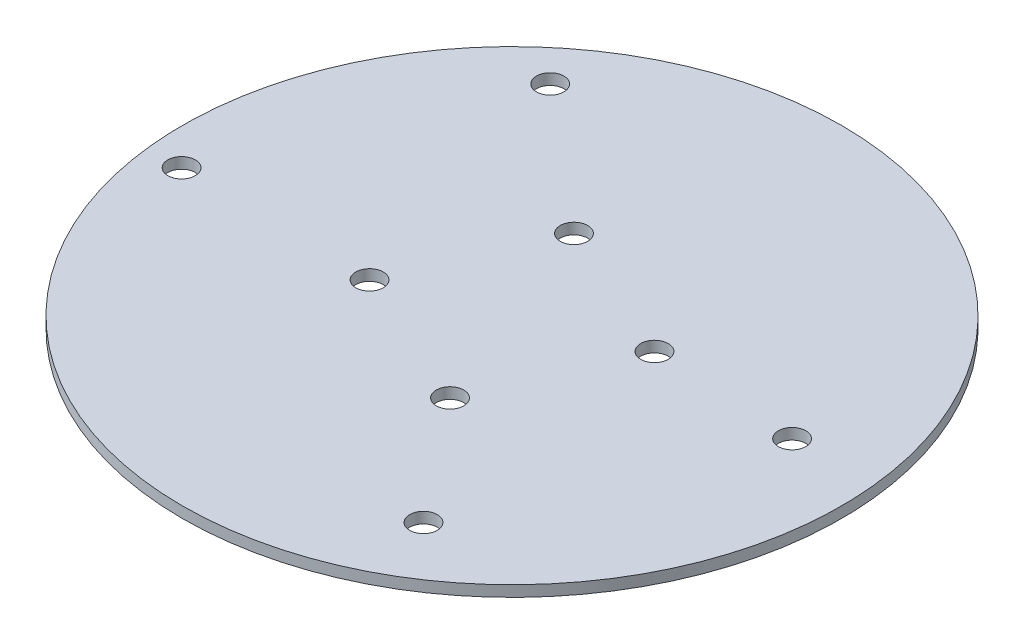
ISO-10303-21;
HEADER;
FILE_DESCRIPTION(('STEP AP214'),'2;1');
FILE_NAME('part.step','',(''),(''),'','','');
FILE_SCHEMA(('AUTOMOTIVE_DESIGN { 1 0 10303 214 1 1 1 1 }'));
ENDSEC;
DATA;
#1=APPLICATION_CONTEXT('core data for automotive mechanical design processes');
#2=APPLICATION_PROTOCOL_DEFINITION('international standard','automotive_design',2000,#1);
#3=PRODUCT_CONTEXT('',#1,'mechanical');
#4=PRODUCT('Part','Part','',(#3));
#5=PRODUCT_RELATED_PRODUCT_CATEGORY('part','',(#4));
#6=PRODUCT_DEFINITION_FORMATION('','',#4);
#7=PRODUCT_DEFINITION_CONTEXT('part definition',#1,'design');
#8=PRODUCT_DEFINITION('design','',#6,#7);
#9=PRODUCT_DEFINITION_SHAPE('','',#8);
#10=(LENGTH_UNIT() NAMED_UNIT(*) SI_UNIT(.MILLI.,.METRE.));
#11=(NAMED_UNIT(*) PLANE_ANGLE_UNIT() SI_UNIT($,.RADIAN.));
#12=(NAMED_UNIT(*) SI_UNIT($,.STERADIAN.) SOLID_ANGLE_UNIT());
#13=UNCERTAINTY_MEASURE_WITH_UNIT(LENGTH_MEASURE(1.E-05),#10,'distance_accuracy_value','');
#14=(GEOMETRIC_REPRESENTATION_CONTEXT(3) GLOBAL_UNCERTAINTY_ASSIGNED_CONTEXT((#13)) GLOBAL_UNIT_ASSIGNED_CONTEXT((#10,
#11,#12)) REPRESENTATION_CONTEXT('',''));
#15=CARTESIAN_POINT('',(0.,0.,0.));
#16=DIRECTION('',(0.,0.,1.));
#17=DIRECTION('',(1.,0.,0.));
#18=AXIS2_PLACEMENT_3D('',#15,#16,#17);
#19=CARTESIAN_POINT('',(0.,2.54,0.));
#20=DIRECTION('',(0.,-1.,0.));
#21=DIRECTION('',(0.,0.,-1.));
#22=AXIS2_PLACEMENT_3D('',#19,#20,#21);
#23=CYLINDRICAL_SURFACE('',#22,76.2);
#24=CARTESIAN_POINT('',(0.,2.54,0.));
#25=DIRECTION('',(0.,1.,0.));
#26=DIRECTION('',(0.,0.,1.));
#27=AXIS2_PLACEMENT_3D('',#24,#25,#26);
#28=CIRCLE('',#27,76.2);
#29=CARTESIAN_POINT('',(0.,2.54,76.2));
#30=VERTEX_POINT('',#29);
#31=EDGE_CURVE('E10',#30,#30,#28,.T.);
#32=ORIENTED_EDGE('',*,*,#31,.F.);
#33=EDGE_LOOP('',(#32));
#34=FACE_BOUND('',#33,.T.);
#35=CARTESIAN_POINT('',(0.,0.,0.));
#36=DIRECTION('',(0.,1.,0.));
#37=DIRECTION('',(0.,0.,1.));
#38=AXIS2_PLACEMENT_3D('',#35,#36,#37);
#39=CIRCLE('',#38,76.2);
#40=CARTESIAN_POINT('',(0.,0.,76.2));
#41=VERTEX_POINT('',#40);
#42=EDGE_CURVE('E34',#41,#41,#39,.T.);
#43=ORIENTED_EDGE('',*,*,#42,.T.);
#44=EDGE_LOOP('',(#43));
#45=FACE_BOUND('',#44,.T.);
#46=ADVANCED_FACE('F31',(#34,#45),#23,.T.);
#47=CARTESIAN_POINT('',(0.,2.54,0.));
#48=DIRECTION('',(0.,1.,0.));
#49=DIRECTION('',(0.,0.,1.));
#50=AXIS2_PLACEMENT_3D('',#47,#48,#49);
#51=PLANE('',#50);
#52=CARTESIAN_POINT('',(-9.30623137465253,2.54,-23.6337482765945));
#53=DIRECTION('',(0.,1.,0.));
#54=DIRECTION('',(0.,0.,1.));
#55=AXIS2_PLACEMENT_3D('',#52,#53,#54);
#56=CIRCLE('',#55,3.175);
#57=CARTESIAN_POINT('',(-9.30623137465253,2.54,-20.4587482765945));
#58=VERTEX_POINT('',#57);
#59=EDGE_CURVE('E85',#58,#58,#56,.T.);
#60=ORIENTED_EDGE('',*,*,#59,.F.);
#61=EDGE_LOOP('',(#60));
#62=FACE_BOUND('',#61,.T.);
#63=CARTESIAN_POINT('',(23.6337482765945,2.54,-9.30623137465261));
#64=DIRECTION('',(0.,1.,0.));
#65=DIRECTION('',(0.,0.,1.));
#66=AXIS2_PLACEMENT_3D('',#63,#64,#65);
#67=CIRCLE('',#66,3.175);
#68=CARTESIAN_POINT('',(23.6337482765945,2.54,-6.13123137465262));
#69=VERTEX_POINT('',#68);
#70=EDGE_CURVE('E79',#69,#69,#67,.T.);
#71=ORIENTED_EDGE('',*,*,#70,.F.);
#72=EDGE_LOOP('',(#71));
#73=FACE_BOUND('',#72,.T.);
#74=CARTESIAN_POINT('',(9.3062313746527,2.54,23.6337482765944));
#75=DIRECTION('',(0.,1.,0.));
#76=DIRECTION('',(0.,0.,1.));
#77=AXIS2_PLACEMENT_3D('',#74,#75,#76);
#78=CIRCLE('',#77,3.175);
#79=CARTESIAN_POINT('',(9.3062313746527,2.54,26.8087482765944));
#80=VERTEX_POINT('',#79);
#81=EDGE_CURVE('E73',#80,#80,#78,.T.);
#82=ORIENTED_EDGE('',*,*,#81,.F.);
#83=EDGE_LOOP('',(#82));
#84=FACE_BOUND('',#83,.T.);
#85=CARTESIAN_POINT('',(-23.6337482765944,2.54,9.30623137465278));
#86=DIRECTION('',(0.,1.,0.));
#87=DIRECTION('',(0.,0.,1.));
#88=AXIS2_PLACEMENT_3D('',#85,#86,#87);
#89=CIRCLE('',#88,3.17499999999997);
#90=CARTESIAN_POINT('',(-23.6337482765944,2.54,12.4812313746527));
#91=VERTEX_POINT('',#90);
#92=EDGE_CURVE('E67',#91,#91,#89,.T.);
#93=ORIENTED_EDGE('',*,*,#92,.F.);
#94=EDGE_LOOP('',(#93));
#95=FACE_BOUND('',#94,.T.);
#96=CARTESIAN_POINT('',(-67.8140618249271,2.54,8.58531875576918));
#97=DIRECTION('',(0.,-1.,0.));
#98=DIRECTION('',(0.,0.,-1.));
#99=AXIS2_PLACEMENT_3D('',#96,#97,#98);
#100=CIRCLE('',#99,3.17499999999997);
#101=CARTESIAN_POINT('',(-67.8140618249271,2.54,5.41031875576921));
#102=VERTEX_POINT('',#101);
#103=EDGE_CURVE('E41',#102,#102,#100,.T.);
#104=ORIENTED_EDGE('',*,*,#103,.T.);
#105=EDGE_LOOP('',(#104));
#106=FACE_BOUND('',#105,.T.);
#107=CARTESIAN_POINT('',(-41.9797967096606,2.54,-50.8094928522671));
#108=DIRECTION('',(0.,-1.,0.));
#109=DIRECTION('',(0.,0.,-1.));
#110=AXIS2_PLACEMENT_3D('',#107,#108,#109);
#111=CIRCLE('',#110,3.17499999999997);
#112=CARTESIAN_POINT('',(-41.9797967096606,2.54,-53.9844928522671));
#113=VERTEX_POINT('',#112);
#114=EDGE_CURVE('E59',#113,#113,#111,.T.);
#115=ORIENTED_EDGE('',*,*,#114,.T.);
#116=EDGE_LOOP('',(#115));
#117=FACE_BOUND('',#116,.T.);
#118=CARTESIAN_POINT('',(57.0115559703999,2.54,-7.75238432682293));
#119=DIRECTION('',(0.,-1.,0.));
#120=DIRECTION('',(0.,0.,-1.));
#121=AXIS2_PLACEMENT_3D('',#118,#119,#120);
#122=CIRCLE('',#121,3.17499999999997);
#123=CARTESIAN_POINT('',(57.0115559703999,2.54,-10.9273843268229));
#124=VERTEX_POINT('',#123);
#125=EDGE_CURVE('E53',#124,#124,#122,.T.);
#126=ORIENTED_EDGE('',*,*,#125,.T.);
#127=EDGE_LOOP('',(#126));
#128=FACE_BOUND('',#127,.T.);
#129=CARTESIAN_POINT('',(31.1772908551334,2.54,51.6424272812133));
#130=DIRECTION('',(0.,-1.,0.));
#131=DIRECTION('',(0.,0.,-1.));
#132=AXIS2_PLACEMENT_3D('',#129,#130,#131);
#133=CIRCLE('',#132,3.17499999999997);
#134=CARTESIAN_POINT('',(31.1772908551334,2.54,48.4674272812134));
#135=VERTEX_POINT('',#134);
#136=EDGE_CURVE('E46',#135,#135,#133,.T.);
#137=ORIENTED_EDGE('',*,*,#136,.T.);
#138=EDGE_LOOP('',(#137));
#139=FACE_BOUND('',#138,.T.);
#140=ORIENTED_EDGE('',*,*,#31,.T.);
#141=EDGE_LOOP('',(#140));
#142=FACE_BOUND('',#141,.T.);
#143=ADVANCED_FACE('F101',(#62,#73,#84,#95,#106,#117,#128,#139,#142),#51,.T.);
#144=CARTESIAN_POINT('',(0.,0.,0.));
#145=DIRECTION('',(0.,1.,0.));
#146=DIRECTION('',(0.,0.,1.));
#147=AXIS2_PLACEMENT_3D('',#144,#145,#146);
#148=PLANE('',#147);
#149=CARTESIAN_POINT('',(-9.30623137465253,0.,-23.6337482765945));
#150=DIRECTION('',(0.,1.,0.));
#151=DIRECTION('',(0.,0.,1.));
#152=AXIS2_PLACEMENT_3D('',#149,#150,#151);
#153=CIRCLE('',#152,3.175);
#154=CARTESIAN_POINT('',(-9.30623137465253,0.,-20.4587482765945));
#155=VERTEX_POINT('',#154);
#156=EDGE_CURVE('E47',#155,#155,#153,.T.);
#157=ORIENTED_EDGE('',*,*,#156,.T.);
#158=EDGE_LOOP('',(#157));
#159=FACE_BOUND('',#158,.T.);
#160=CARTESIAN_POINT('',(23.6337482765945,0.,-9.30623137465261));
#161=DIRECTION('',(0.,1.,0.));
#162=DIRECTION('',(0.,0.,1.));
#163=AXIS2_PLACEMENT_3D('',#160,#161,#162);
#164=CIRCLE('',#163,3.175);
#165=CARTESIAN_POINT('',(23.6337482765945,0.,-6.13123137465262));
#166=VERTEX_POINT('',#165);
#167=EDGE_CURVE('E82',#166,#166,#164,.T.);
#168=ORIENTED_EDGE('',*,*,#167,.T.);
#169=EDGE_LOOP('',(#168));
#170=FACE_BOUND('',#169,.T.);
#171=CARTESIAN_POINT('',(9.3062313746527,0.,23.6337482765944));
#172=DIRECTION('',(0.,1.,0.));
#173=DIRECTION('',(0.,0.,1.));
#174=AXIS2_PLACEMENT_3D('',#171,#172,#173);
#175=CIRCLE('',#174,3.175);
#176=CARTESIAN_POINT('',(9.3062313746527,0.,26.8087482765944));
#177=VERTEX_POINT('',#176);
#178=EDGE_CURVE('E76',#177,#177,#175,.T.);
#179=ORIENTED_EDGE('',*,*,#178,.T.);
#180=EDGE_LOOP('',(#179));
#181=FACE_BOUND('',#180,.T.);
#182=CARTESIAN_POINT('',(-23.6337482765944,0.,9.30623137465278));
#183=DIRECTION('',(0.,1.,0.));
#184=DIRECTION('',(0.,0.,1.));
#185=AXIS2_PLACEMENT_3D('',#182,#183,#184);
#186=CIRCLE('',#185,3.17499999999997);
#187=CARTESIAN_POINT('',(-23.6337482765944,0.,12.4812313746527));
#188=VERTEX_POINT('',#187);
#189=EDGE_CURVE('E70',#188,#188,#186,.T.);
#190=ORIENTED_EDGE('',*,*,#189,.T.);
#191=EDGE_LOOP('',(#190));
#192=FACE_BOUND('',#191,.T.);
#193=CARTESIAN_POINT('',(-67.8140618249271,0.,8.58531875576918));
#194=DIRECTION('',(0.,-1.,0.));
#195=DIRECTION('',(0.,0.,-1.));
#196=AXIS2_PLACEMENT_3D('',#193,#194,#195);
#197=CIRCLE('',#196,3.17499999999997);
#198=CARTESIAN_POINT('',(-67.8140618249271,0.,5.41031875576921));
#199=VERTEX_POINT('',#198);
#200=EDGE_CURVE('E62',#199,#199,#197,.T.);
#201=ORIENTED_EDGE('',*,*,#200,.F.);
#202=EDGE_LOOP('',(#201));
#203=FACE_BOUND('',#202,.T.);
#204=CARTESIAN_POINT('',(-41.9797967096606,0.,-50.8094928522671));
#205=DIRECTION('',(0.,-1.,0.));
#206=DIRECTION('',(0.,0.,-1.));
#207=AXIS2_PLACEMENT_3D('',#204,#205,#206);
#208=CIRCLE('',#207,3.17499999999997);
#209=CARTESIAN_POINT('',(-41.9797967096606,0.,-53.9844928522671));
#210=VERTEX_POINT('',#209);
#211=EDGE_CURVE('E56',#210,#210,#208,.T.);
#212=ORIENTED_EDGE('',*,*,#211,.F.);
#213=EDGE_LOOP('',(#212));
#214=FACE_BOUND('',#213,.T.);
#215=CARTESIAN_POINT('',(57.0115559703999,0.,-7.75238432682293));
#216=DIRECTION('',(0.,-1.,0.));
#217=DIRECTION('',(0.,0.,-1.));
#218=AXIS2_PLACEMENT_3D('',#215,#216,#217);
#219=CIRCLE('',#218,3.17499999999997);
#220=CARTESIAN_POINT('',(57.0115559703999,0.,-10.9273843268229));
#221=VERTEX_POINT('',#220);
#222=EDGE_CURVE('E50',#221,#221,#219,.T.);
#223=ORIENTED_EDGE('',*,*,#222,.F.);
#224=EDGE_LOOP('',(#223));
#225=FACE_BOUND('',#224,.T.);
#226=CARTESIAN_POINT('',(31.1772908551334,0.,51.6424272812133));
#227=DIRECTION('',(0.,-1.,0.));
#228=DIRECTION('',(0.,0.,-1.));
#229=AXIS2_PLACEMENT_3D('',#226,#227,#228);
#230=CIRCLE('',#229,3.17499999999997);
#231=CARTESIAN_POINT('',(31.1772908551334,0.,48.4674272812134));
#232=VERTEX_POINT('',#231);
#233=EDGE_CURVE('E43',#232,#232,#230,.T.);
#234=ORIENTED_EDGE('',*,*,#233,.F.);
#235=EDGE_LOOP('',(#234));
#236=FACE_BOUND('',#235,.T.);
#237=ORIENTED_EDGE('',*,*,#42,.F.);
#238=EDGE_LOOP('',(#237));
#239=FACE_BOUND('',#238,.T.);
#240=ADVANCED_FACE('F91',(#159,#170,#181,#192,#203,#214,#225,#236,#239),#148,.F.);
#241=CARTESIAN_POINT('',(31.1772908551334,2.54,51.6424272812133));
#242=DIRECTION('',(0.,-1.,0.));
#243=DIRECTION('',(0.,0.,-1.));
#244=AXIS2_PLACEMENT_3D('',#241,#242,#243);
#245=CYLINDRICAL_SURFACE('',#244,3.17499999999997);
#246=ORIENTED_EDGE('',*,*,#136,.F.);
#247=EDGE_LOOP('',(#246));
#248=FACE_BOUND('',#247,.T.);
#249=ORIENTED_EDGE('',*,*,#233,.T.);
#250=EDGE_LOOP('',(#249));
#251=FACE_BOUND('',#250,.T.);
#252=ADVANCED_FACE('F119',(#248,#251),#245,.F.);
#253=CARTESIAN_POINT('',(57.0115559703999,2.54,-7.75238432682293));
#254=DIRECTION('',(0.,-1.,0.));
#255=DIRECTION('',(0.,0.,-1.));
#256=AXIS2_PLACEMENT_3D('',#253,#254,#255);
#257=CYLINDRICAL_SURFACE('',#256,3.17499999999997);
#258=ORIENTED_EDGE('',*,*,#125,.F.);
#259=EDGE_LOOP('',(#258));
#260=FACE_BOUND('',#259,.T.);
#261=ORIENTED_EDGE('',*,*,#222,.T.);
#262=EDGE_LOOP('',(#261));
#263=FACE_BOUND('',#262,.T.);
#264=ADVANCED_FACE('F122',(#260,#263),#257,.F.);
#265=CARTESIAN_POINT('',(-41.9797967096606,2.54,-50.8094928522671));
#266=DIRECTION('',(0.,-1.,0.));
#267=DIRECTION('',(0.,0.,-1.));
#268=AXIS2_PLACEMENT_3D('',#265,#266,#267);
#269=CYLINDRICAL_SURFACE('',#268,3.17499999999997);
#270=ORIENTED_EDGE('',*,*,#114,.F.);
#271=EDGE_LOOP('',(#270));
#272=FACE_BOUND('',#271,.T.);
#273=ORIENTED_EDGE('',*,*,#211,.T.);
#274=EDGE_LOOP('',(#273));
#275=FACE_BOUND('',#274,.T.);
#276=ADVANCED_FACE('F154',(#272,#275),#269,.F.);
#277=CARTESIAN_POINT('',(-67.8140618249271,2.54,8.58531875576918));
#278=DIRECTION('',(0.,-1.,0.));
#279=DIRECTION('',(0.,0.,-1.));
#280=AXIS2_PLACEMENT_3D('',#277,#278,#279);
#281=CYLINDRICAL_SURFACE('',#280,3.17499999999997);
#282=ORIENTED_EDGE('',*,*,#103,.F.);
#283=EDGE_LOOP('',(#282));
#284=FACE_BOUND('',#283,.T.);
#285=ORIENTED_EDGE('',*,*,#200,.T.);
#286=EDGE_LOOP('',(#285));
#287=FACE_BOUND('',#286,.T.);
#288=ADVANCED_FACE('F162',(#284,#287),#281,.F.);
#289=CARTESIAN_POINT('',(-23.6337482765944,0.,9.30623137465278));
#290=DIRECTION('',(0.,1.,0.));
#291=DIRECTION('',(0.,0.,1.));
#292=AXIS2_PLACEMENT_3D('',#289,#290,#291);
#293=CYLINDRICAL_SURFACE('',#292,3.17499999999997);
#294=ORIENTED_EDGE('',*,*,#189,.F.);
#295=EDGE_LOOP('',(#294));
#296=FACE_BOUND('',#295,.T.);
#297=ORIENTED_EDGE('',*,*,#92,.T.);
#298=EDGE_LOOP('',(#297));
#299=FACE_BOUND('',#298,.T.);
#300=ADVANCED_FACE('F169',(#296,#299),#293,.F.);
#301=CARTESIAN_POINT('',(9.3062313746527,0.,23.6337482765944));
#302=DIRECTION('',(0.,1.,0.));
#303=DIRECTION('',(0.,0.,1.));
#304=AXIS2_PLACEMENT_3D('',#301,#302,#303);
#305=CYLINDRICAL_SURFACE('',#304,3.175);
#306=ORIENTED_EDGE('',*,*,#178,.F.);
#307=EDGE_LOOP('',(#306));
#308=FACE_BOUND('',#307,.T.);
#309=ORIENTED_EDGE('',*,*,#81,.T.);
#310=EDGE_LOOP('',(#309));
#311=FACE_BOUND('',#310,.T.);
#312=ADVANCED_FACE('F176',(#308,#311),#305,.F.);
#313=CARTESIAN_POINT('',(23.6337482765945,0.,-9.30623137465261));
#314=DIRECTION('',(0.,1.,0.));
#315=DIRECTION('',(0.,0.,1.));
#316=AXIS2_PLACEMENT_3D('',#313,#314,#315);
#317=CYLINDRICAL_SURFACE('',#316,3.175);
#318=ORIENTED_EDGE('',*,*,#167,.F.);
#319=EDGE_LOOP('',(#318));
#320=FACE_BOUND('',#319,.T.);
#321=ORIENTED_EDGE('',*,*,#70,.T.);
#322=EDGE_LOOP('',(#321));
#323=FACE_BOUND('',#322,.T.);
#324=ADVANCED_FACE('F97',(#320,#323),#317,.F.);
#325=CARTESIAN_POINT('',(-9.30623137465253,0.,-23.6337482765945));
#326=DIRECTION('',(0.,1.,0.));
#327=DIRECTION('',(0.,0.,1.));
#328=AXIS2_PLACEMENT_3D('',#325,#326,#327);
#329=CYLINDRICAL_SURFACE('',#328,3.175);
#330=ORIENTED_EDGE('',*,*,#156,.F.);
#331=EDGE_LOOP('',(#330));
#332=FACE_BOUND('',#331,.T.);
#333=ORIENTED_EDGE('',*,*,#59,.T.);
#334=EDGE_LOOP('',(#333));
#335=FACE_BOUND('',#334,.T.);
#336=ADVANCED_FACE('F94',(#332,#335),#329,.F.);
#337=CLOSED_SHELL('',(#46,#143,#240,#252,#264,#276,#288,#300,#312,#324,#336));
#338=MANIFOLD_SOLID_BREP('B2',#337);
#339=ADVANCED_BREP_SHAPE_REPRESENTATION('',(#18,#338),#14);
#340=SHAPE_DEFINITION_REPRESENTATION(#9,#339);
ENDSEC;
END-ISO-10303-21;
